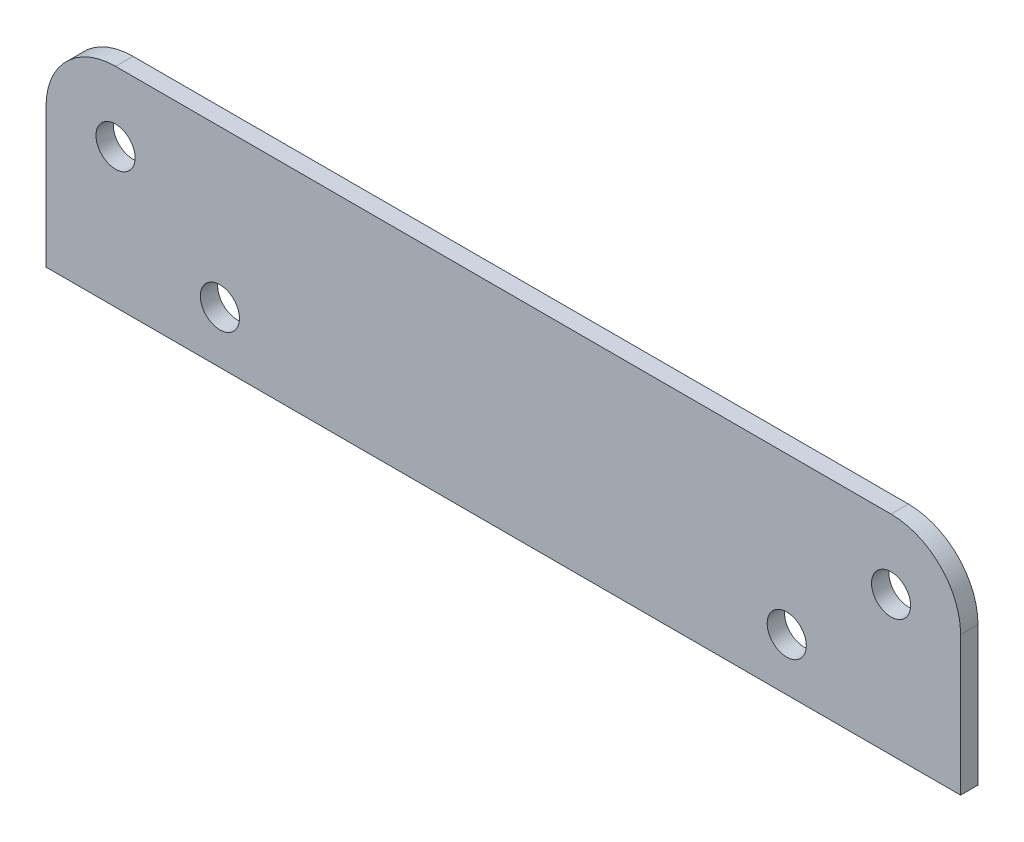
ISO-10303-21;
HEADER;
FILE_DESCRIPTION(('STEP AP214'),'2;1');
FILE_NAME('part.step','',(''),(''),'','','');
FILE_SCHEMA(('AUTOMOTIVE_DESIGN { 1 0 10303 214 1 1 1 1 }'));
ENDSEC;
DATA;
#1=APPLICATION_CONTEXT('core data for automotive mechanical design processes');
#2=APPLICATION_PROTOCOL_DEFINITION('international standard','automotive_design',2000,#1);
#3=PRODUCT_CONTEXT('',#1,'mechanical');
#4=PRODUCT('Part','Part','',(#3));
#5=PRODUCT_RELATED_PRODUCT_CATEGORY('part','',(#4));
#6=PRODUCT_DEFINITION_FORMATION('','',#4);
#7=PRODUCT_DEFINITION_CONTEXT('part definition',#1,'design');
#8=PRODUCT_DEFINITION('design','',#6,#7);
#9=PRODUCT_DEFINITION_SHAPE('','',#8);
#10=(LENGTH_UNIT() NAMED_UNIT(*) SI_UNIT(.MILLI.,.METRE.));
#11=(NAMED_UNIT(*) PLANE_ANGLE_UNIT() SI_UNIT($,.RADIAN.));
#12=(NAMED_UNIT(*) SI_UNIT($,.STERADIAN.) SOLID_ANGLE_UNIT());
#13=UNCERTAINTY_MEASURE_WITH_UNIT(LENGTH_MEASURE(1.E-05),#10,'distance_accuracy_value','');
#14=(GEOMETRIC_REPRESENTATION_CONTEXT(3) GLOBAL_UNCERTAINTY_ASSIGNED_CONTEXT((#13)) GLOBAL_UNIT_ASSIGNED_CONTEXT((#10,
#11,#12)) REPRESENTATION_CONTEXT('',''));
#15=CARTESIAN_POINT('',(0.,0.,0.));
#16=DIRECTION('',(0.,0.,1.));
#17=DIRECTION('',(1.,0.,0.));
#18=AXIS2_PLACEMENT_3D('',#15,#16,#17);
#19=CARTESIAN_POINT('',(83.5025000000007,-1713.14345438019,3.17500000000148));
#20=DIRECTION('',(-1.,0.,0.));
#21=DIRECTION('',(0.,0.,1.));
#22=AXIS2_PLACEMENT_3D('',#19,#20,#21);
#23=PLANE('',#22);
#24=DIRECTION('',(0.,1.,0.));
#25=VECTOR('',#24,1.);
#26=CARTESIAN_POINT('',(83.5025000000004,-1713.14345438019,0.));
#27=LINE('',#26,#25);
#28=CARTESIAN_POINT('',(83.5025000000004,-1713.14345438019,0.));
#29=VERTEX_POINT('',#28);
#30=CARTESIAN_POINT('',(83.5025000000004,-1687.74345438019,0.));
#31=VERTEX_POINT('',#30);
#32=EDGE_CURVE('E130',#29,#31,#27,.T.);
#33=ORIENTED_EDGE('',*,*,#32,.T.);
#34=DIRECTION('',(0.,0.,-1.));
#35=VECTOR('',#34,1.);
#36=CARTESIAN_POINT('',(83.5025000000006,-1687.74345438019,3.17499999999615));
#37=LINE('',#36,#35);
#38=CARTESIAN_POINT('',(83.5025000000006,-1687.74345438019,3.17499999999615));
#39=VERTEX_POINT('',#38);
#40=EDGE_CURVE('E69',#31,#39,#37,.F.);
#41=ORIENTED_EDGE('',*,*,#40,.T.);
#42=DIRECTION('',(0.,1.,0.));
#43=VECTOR('',#42,1.);
#44=CARTESIAN_POINT('',(83.5025000000007,-1713.14345438019,3.17500000000148));
#45=LINE('',#44,#43);
#46=CARTESIAN_POINT('',(83.5025000000007,-1713.14345438019,3.17500000000148));
#47=VERTEX_POINT('',#46);
#48=EDGE_CURVE('E141',#47,#39,#45,.T.);
#49=ORIENTED_EDGE('',*,*,#48,.F.);
#50=DIRECTION('',(0.,0.,-1.));
#51=VECTOR('',#50,1.);
#52=CARTESIAN_POINT('',(83.5025000000007,-1713.14345438019,3.17500000000148));
#53=LINE('',#52,#51);
#54=EDGE_CURVE('E119',#47,#29,#53,.T.);
#55=ORIENTED_EDGE('',*,*,#54,.T.);
#56=EDGE_LOOP('',(#33,#41,#49,#55));
#57=FACE_BOUND('',#56,.T.);
#58=ADVANCED_FACE('F45',(#57),#23,.F.);
#59=CARTESIAN_POINT('',(83.5025000000007,-1675.04345438019,3.17500000000059));
#60=DIRECTION('',(0.,-1.,0.));
#61=DIRECTION('',(0.,0.,-1.));
#62=AXIS2_PLACEMENT_3D('',#59,#60,#61);
#63=PLANE('',#62);
#64=DIRECTION('',(-1.,0.,0.));
#65=VECTOR('',#64,1.);
#66=CARTESIAN_POINT('',(83.5025000000007,-1675.04345438019,3.17500000000059));
#67=LINE('',#66,#65);
#68=CARTESIAN_POINT('',(70.8025000000006,-1675.04345438019,3.17500000000059));
#69=VERTEX_POINT('',#68);
#70=CARTESIAN_POINT('',(-70.8025,-1675.04345438019,3.17500000000059));
#71=VERTEX_POINT('',#70);
#72=EDGE_CURVE('E108',#69,#71,#67,.T.);
#73=ORIENTED_EDGE('',*,*,#72,.F.);
#74=DIRECTION('',(0.,0.,-1.));
#75=VECTOR('',#74,1.);
#76=CARTESIAN_POINT('',(70.8025000000006,-1675.04345438019,3.17500000000059));
#77=LINE('',#76,#75);
#78=CARTESIAN_POINT('',(70.8025000000003,-1675.04345438019,7.105427357601E-12));
#79=VERTEX_POINT('',#78);
#80=EDGE_CURVE('E145',#69,#79,#77,.T.);
#81=ORIENTED_EDGE('',*,*,#80,.T.);
#82=DIRECTION('',(-1.,0.,0.));
#83=VECTOR('',#82,1.);
#84=CARTESIAN_POINT('',(83.5025000000004,-1675.04345438019,7.105427357601E-12));
#85=LINE('',#84,#83);
#86=CARTESIAN_POINT('',(-70.8025000000002,-1675.04345438019,7.105427357601E-12));
#87=VERTEX_POINT('',#86);
#88=EDGE_CURVE('E133',#79,#87,#85,.T.);
#89=ORIENTED_EDGE('',*,*,#88,.T.);
#90=DIRECTION('',(0.,0.,-1.));
#91=VECTOR('',#90,1.);
#92=CARTESIAN_POINT('',(-70.8025,-1675.04345438019,3.17500000000059));
#93=LINE('',#92,#91);
#94=EDGE_CURVE('E118',#87,#71,#93,.F.);
#95=ORIENTED_EDGE('',*,*,#94,.T.);
#96=EDGE_LOOP('',(#73,#81,#89,#95));
#97=FACE_BOUND('',#96,.T.);
#98=ADVANCED_FACE('F165',(#97),#63,.F.);
#99=CARTESIAN_POINT('',(-83.5024999999999,-1713.14345438019,3.17500000000148));
#100=DIRECTION('',(1.,0.,0.));
#101=DIRECTION('',(0.,1.,0.));
#102=AXIS2_PLACEMENT_3D('',#99,#100,#101);
#103=PLANE('',#102);
#104=DIRECTION('',(0.,-1.,0.));
#105=VECTOR('',#104,1.);
#106=CARTESIAN_POINT('',(-83.5024999999999,-1713.14345438019,3.17500000000148));
#107=LINE('',#106,#105);
#108=CARTESIAN_POINT('',(-83.5025,-1687.74345438019,3.17499999999615));
#109=VERTEX_POINT('',#108);
#110=CARTESIAN_POINT('',(-83.5024999999999,-1713.14345438019,3.17500000000148));
#111=VERTEX_POINT('',#110);
#112=EDGE_CURVE('E99',#109,#111,#107,.T.);
#113=ORIENTED_EDGE('',*,*,#112,.F.);
#114=DIRECTION('',(0.,0.,-1.));
#115=VECTOR('',#114,1.);
#116=CARTESIAN_POINT('',(-83.5025,-1687.74345438019,3.17499999999615));
#117=LINE('',#116,#115);
#118=CARTESIAN_POINT('',(-83.5025000000002,-1687.74345438019,0.));
#119=VERTEX_POINT('',#118);
#120=EDGE_CURVE('E11',#109,#119,#117,.T.);
#121=ORIENTED_EDGE('',*,*,#120,.T.);
#122=DIRECTION('',(0.,-1.,0.));
#123=VECTOR('',#122,1.);
#124=CARTESIAN_POINT('',(-83.5025000000004,-1713.14345438019,0.));
#125=LINE('',#124,#123);
#126=CARTESIAN_POINT('',(-83.5025000000004,-1713.14345438019,0.));
#127=VERTEX_POINT('',#126);
#128=EDGE_CURVE('E114',#119,#127,#125,.T.);
#129=ORIENTED_EDGE('',*,*,#128,.T.);
#130=DIRECTION('',(0.,0.,-1.));
#131=VECTOR('',#130,1.);
#132=CARTESIAN_POINT('',(-83.5024999999999,-1713.14345438019,3.17500000000148));
#133=LINE('',#132,#131);
#134=EDGE_CURVE('E111',#111,#127,#133,.T.);
#135=ORIENTED_EDGE('',*,*,#134,.F.);
#136=EDGE_LOOP('',(#113,#121,#129,#135));
#137=FACE_BOUND('',#136,.T.);
#138=ADVANCED_FACE('F112',(#137),#103,.F.);
#139=CARTESIAN_POINT('',(83.5025000000007,-1713.14345438019,3.17500000000148));
#140=DIRECTION('',(0.,1.,0.));
#141=DIRECTION('',(0.,0.,1.));
#142=AXIS2_PLACEMENT_3D('',#139,#140,#141);
#143=PLANE('',#142);
#144=DIRECTION('',(1.,0.,0.));
#145=VECTOR('',#144,1.);
#146=CARTESIAN_POINT('',(83.5025000000004,-1713.14345438019,0.));
#147=LINE('',#146,#145);
#148=EDGE_CURVE('E140',#127,#29,#147,.T.);
#149=ORIENTED_EDGE('',*,*,#148,.T.);
#150=ORIENTED_EDGE('',*,*,#54,.F.);
#151=DIRECTION('',(1.,0.,0.));
#152=VECTOR('',#151,1.);
#153=CARTESIAN_POINT('',(83.5025000000007,-1713.14345438019,3.17500000000148));
#154=LINE('',#153,#152);
#155=EDGE_CURVE('E103',#111,#47,#154,.T.);
#156=ORIENTED_EDGE('',*,*,#155,.F.);
#157=ORIENTED_EDGE('',*,*,#134,.T.);
#158=EDGE_LOOP('',(#149,#150,#156,#157));
#159=FACE_BOUND('',#158,.T.);
#160=ADVANCED_FACE('F121',(#159),#143,.F.);
#161=CARTESIAN_POINT('',(0.,1.33226762955019E-12,3.17500000000059));
#162=DIRECTION('',(0.,0.,1.));
#163=DIRECTION('',(1.,0.,0.));
#164=AXIS2_PLACEMENT_3D('',#161,#162,#163);
#165=PLANE('',#164);
#166=CARTESIAN_POINT('',(-70.8025000000001,-1687.74345438019,3.17499999999615));
#167=DIRECTION('',(0.,0.,1.));
#168=DIRECTION('',(1.,0.,0.));
#169=AXIS2_PLACEMENT_3D('',#166,#167,#168);
#170=CIRCLE('',#169,3.57124);
#171=CARTESIAN_POINT('',(-67.2312600000001,-1687.74345438019,3.17499999999615));
#172=VERTEX_POINT('',#171);
#173=EDGE_CURVE('E202',#172,#172,#170,.T.);
#174=ORIENTED_EDGE('',*,*,#173,.F.);
#175=EDGE_LOOP('',(#174));
#176=FACE_BOUND('',#175,.T.);
#177=CARTESIAN_POINT('',(70.8025000000003,-1687.74345438019,3.17500000000326));
#178=DIRECTION('',(0.,0.,1.));
#179=DIRECTION('',(1.,0.,0.));
#180=AXIS2_PLACEMENT_3D('',#177,#178,#179);
#181=CIRCLE('',#180,3.57124);
#182=CARTESIAN_POINT('',(74.3737400000003,-1687.74345438019,3.17500000000326));
#183=VERTEX_POINT('',#182);
#184=EDGE_CURVE('E195',#183,#183,#181,.T.);
#185=ORIENTED_EDGE('',*,*,#184,.F.);
#186=EDGE_LOOP('',(#185));
#187=FACE_BOUND('',#186,.T.);
#188=CARTESIAN_POINT('',(51.7525000000002,-1703.61845438019,3.17500000000059));
#189=DIRECTION('',(0.,0.,1.));
#190=DIRECTION('',(1.,0.,0.));
#191=AXIS2_PLACEMENT_3D('',#188,#189,#190);
#192=CIRCLE('',#191,3.57124);
#193=CARTESIAN_POINT('',(55.3237400000002,-1703.61845438019,3.17500000000059));
#194=VERTEX_POINT('',#193);
#195=EDGE_CURVE('E187',#194,#194,#192,.T.);
#196=ORIENTED_EDGE('',*,*,#195,.F.);
#197=EDGE_LOOP('',(#196));
#198=FACE_BOUND('',#197,.T.);
#199=CARTESIAN_POINT('',(-51.7524999999996,-1703.61845438019,3.17500000002191));
#200=DIRECTION('',(0.,0.,1.));
#201=DIRECTION('',(1.,0.,0.));
#202=AXIS2_PLACEMENT_3D('',#199,#200,#201);
#203=CIRCLE('',#202,3.57124);
#204=CARTESIAN_POINT('',(-48.1812599999996,-1703.61845438019,3.17500000002191));
#205=VERTEX_POINT('',#204);
#206=EDGE_CURVE('E179',#205,#205,#203,.T.);
#207=ORIENTED_EDGE('',*,*,#206,.F.);
#208=EDGE_LOOP('',(#207));
#209=FACE_BOUND('',#208,.T.);
#210=ORIENTED_EDGE('',*,*,#48,.T.);
#211=CARTESIAN_POINT('',(70.8025000000003,-1687.74345438019,3.17500000000326));
#212=DIRECTION('',(0.,0.,1.));
#213=DIRECTION('',(1.,0.,0.));
#214=AXIS2_PLACEMENT_3D('',#211,#212,#213);
#215=CIRCLE('',#214,12.7);
#216=EDGE_CURVE('E54',#39,#69,#215,.T.);
#217=ORIENTED_EDGE('',*,*,#216,.T.);
#218=ORIENTED_EDGE('',*,*,#72,.T.);
#219=CARTESIAN_POINT('',(-70.8025000000001,-1687.74345438019,3.17499999999615));
#220=DIRECTION('',(0.,0.,1.));
#221=DIRECTION('',(1.,0.,0.));
#222=AXIS2_PLACEMENT_3D('',#219,#220,#221);
#223=CIRCLE('',#222,12.7);
#224=EDGE_CURVE('E61',#71,#109,#223,.T.);
#225=ORIENTED_EDGE('',*,*,#224,.T.);
#226=ORIENTED_EDGE('',*,*,#112,.T.);
#227=ORIENTED_EDGE('',*,*,#155,.T.);
#228=EDGE_LOOP('',(#210,#217,#218,#225,#226,#227));
#229=FACE_BOUND('',#228,.T.);
#230=ADVANCED_FACE('F101',(#176,#187,#198,#209,#229),#165,.T.);
#231=CARTESIAN_POINT('',(0.,0.,0.));
#232=DIRECTION('',(0.,0.,1.));
#233=DIRECTION('',(1.,0.,0.));
#234=AXIS2_PLACEMENT_3D('',#231,#232,#233);
#235=PLANE('',#234);
#236=CARTESIAN_POINT('',(-70.8025000000001,-1687.74345438019,0.));
#237=DIRECTION('',(0.,0.,1.));
#238=DIRECTION('',(1.,0.,0.));
#239=AXIS2_PLACEMENT_3D('',#236,#237,#238);
#240=CIRCLE('',#239,3.57124);
#241=CARTESIAN_POINT('',(-67.2312600000001,-1687.74345438019,0.));
#242=VERTEX_POINT('',#241);
#243=EDGE_CURVE('E198',#242,#242,#240,.T.);
#244=ORIENTED_EDGE('',*,*,#243,.T.);
#245=EDGE_LOOP('',(#244));
#246=FACE_BOUND('',#245,.T.);
#247=CARTESIAN_POINT('',(70.8025000000003,-1687.74345438019,0.));
#248=DIRECTION('',(0.,0.,1.));
#249=DIRECTION('',(1.,0.,0.));
#250=AXIS2_PLACEMENT_3D('',#247,#248,#249);
#251=CIRCLE('',#250,3.57124);
#252=CARTESIAN_POINT('',(74.3737400000003,-1687.74345438019,0.));
#253=VERTEX_POINT('',#252);
#254=EDGE_CURVE('E191',#253,#253,#251,.T.);
#255=ORIENTED_EDGE('',*,*,#254,.T.);
#256=EDGE_LOOP('',(#255));
#257=FACE_BOUND('',#256,.T.);
#258=CARTESIAN_POINT('',(51.7525000000003,-1703.61845438019,7.105427357601E-12));
#259=DIRECTION('',(0.,0.,1.));
#260=DIRECTION('',(1.,0.,0.));
#261=AXIS2_PLACEMENT_3D('',#258,#259,#260);
#262=CIRCLE('',#261,3.57124);
#263=CARTESIAN_POINT('',(55.3237400000002,-1703.61845438019,7.10522911395728E-12));
#264=VERTEX_POINT('',#263);
#265=EDGE_CURVE('E183',#264,#264,#262,.T.);
#266=ORIENTED_EDGE('',*,*,#265,.T.);
#267=EDGE_LOOP('',(#266));
#268=FACE_BOUND('',#267,.T.);
#269=CARTESIAN_POINT('',(-51.7524999999996,-1703.61845438019,4.44089209850063E-12));
#270=DIRECTION('',(0.,0.,1.));
#271=DIRECTION('',(1.,0.,0.));
#272=AXIS2_PLACEMENT_3D('',#269,#270,#271);
#273=CIRCLE('',#272,3.57124);
#274=CARTESIAN_POINT('',(-48.1812599999996,-1703.61845438019,4.4406938548569E-12));
#275=VERTEX_POINT('',#274);
#276=EDGE_CURVE('E134',#275,#275,#273,.T.);
#277=ORIENTED_EDGE('',*,*,#276,.T.);
#278=EDGE_LOOP('',(#277));
#279=FACE_BOUND('',#278,.T.);
#280=ORIENTED_EDGE('',*,*,#88,.F.);
#281=CARTESIAN_POINT('',(70.8025000000003,-1687.74345438019,0.));
#282=DIRECTION('',(0.,0.,1.));
#283=DIRECTION('',(1.,0.,0.));
#284=AXIS2_PLACEMENT_3D('',#281,#282,#283);
#285=CIRCLE('',#284,12.7);
#286=EDGE_CURVE('E152',#79,#31,#285,.F.);
#287=ORIENTED_EDGE('',*,*,#286,.T.);
#288=ORIENTED_EDGE('',*,*,#32,.F.);
#289=ORIENTED_EDGE('',*,*,#148,.F.);
#290=ORIENTED_EDGE('',*,*,#128,.F.);
#291=CARTESIAN_POINT('',(-70.8025000000001,-1687.74345438019,0.));
#292=DIRECTION('',(0.,0.,1.));
#293=DIRECTION('',(1.,0.,0.));
#294=AXIS2_PLACEMENT_3D('',#291,#292,#293);
#295=CIRCLE('',#294,12.7);
#296=EDGE_CURVE('E149',#119,#87,#295,.F.);
#297=ORIENTED_EDGE('',*,*,#296,.T.);
#298=EDGE_LOOP('',(#280,#287,#288,#289,#290,#297));
#299=FACE_BOUND('',#298,.T.);
#300=ADVANCED_FACE('F172',(#246,#257,#268,#279,#299),#235,.F.);
#301=CARTESIAN_POINT('',(70.8025000000003,-1687.74345438019,3.17500000000326));
#302=DIRECTION('',(0.,0.,-1.));
#303=DIRECTION('',(-1.,0.,0.));
#304=AXIS2_PLACEMENT_3D('',#301,#302,#303);
#305=CYLINDRICAL_SURFACE('',#304,12.7);
#306=ORIENTED_EDGE('',*,*,#216,.F.);
#307=ORIENTED_EDGE('',*,*,#40,.F.);
#308=ORIENTED_EDGE('',*,*,#286,.F.);
#309=ORIENTED_EDGE('',*,*,#80,.F.);
#310=EDGE_LOOP('',(#306,#307,#308,#309));
#311=FACE_BOUND('',#310,.T.);
#312=ADVANCED_FACE('F169',(#311),#305,.T.);
#313=CARTESIAN_POINT('',(-70.8025000000001,-1687.74345438019,3.17499999999615));
#314=DIRECTION('',(0.,0.,-1.));
#315=DIRECTION('',(-1.,0.,0.));
#316=AXIS2_PLACEMENT_3D('',#313,#314,#315);
#317=CYLINDRICAL_SURFACE('',#316,12.7);
#318=ORIENTED_EDGE('',*,*,#224,.F.);
#319=ORIENTED_EDGE('',*,*,#94,.F.);
#320=ORIENTED_EDGE('',*,*,#296,.F.);
#321=ORIENTED_EDGE('',*,*,#120,.F.);
#322=EDGE_LOOP('',(#318,#319,#320,#321));
#323=FACE_BOUND('',#322,.T.);
#324=ADVANCED_FACE('F47',(#323),#317,.T.);
#325=CARTESIAN_POINT('',(-51.7524999999996,-1703.61845438019,3.17500000002191));
#326=DIRECTION('',(0.,0.,1.));
#327=DIRECTION('',(1.,0.,0.));
#328=AXIS2_PLACEMENT_3D('',#325,#326,#327);
#329=CYLINDRICAL_SURFACE('',#328,3.57124);
#330=ORIENTED_EDGE('',*,*,#276,.F.);
#331=EDGE_LOOP('',(#330));
#332=FACE_BOUND('',#331,.T.);
#333=ORIENTED_EDGE('',*,*,#206,.T.);
#334=EDGE_LOOP('',(#333));
#335=FACE_BOUND('',#334,.T.);
#336=ADVANCED_FACE('F218',(#332,#335),#329,.F.);
#337=CARTESIAN_POINT('',(51.7525000000002,-1703.61845438019,3.17500000000059));
#338=DIRECTION('',(0.,0.,1.));
#339=DIRECTION('',(1.,0.,0.));
#340=AXIS2_PLACEMENT_3D('',#337,#338,#339);
#341=CYLINDRICAL_SURFACE('',#340,3.57124);
#342=ORIENTED_EDGE('',*,*,#265,.F.);
#343=EDGE_LOOP('',(#342));
#344=FACE_BOUND('',#343,.T.);
#345=ORIENTED_EDGE('',*,*,#195,.T.);
#346=EDGE_LOOP('',(#345));
#347=FACE_BOUND('',#346,.T.);
#348=ADVANCED_FACE('F220',(#344,#347),#341,.F.);
#349=CARTESIAN_POINT('',(70.8025000000003,-1687.74345438019,3.17500000000326));
#350=DIRECTION('',(0.,0.,1.));
#351=DIRECTION('',(1.,0.,0.));
#352=AXIS2_PLACEMENT_3D('',#349,#350,#351);
#353=CYLINDRICAL_SURFACE('',#352,3.57124);
#354=ORIENTED_EDGE('',*,*,#254,.F.);
#355=EDGE_LOOP('',(#354));
#356=FACE_BOUND('',#355,.T.);
#357=ORIENTED_EDGE('',*,*,#184,.T.);
#358=EDGE_LOOP('',(#357));
#359=FACE_BOUND('',#358,.T.);
#360=ADVANCED_FACE('F227',(#356,#359),#353,.F.);
#361=CARTESIAN_POINT('',(-70.8025000000001,-1687.74345438019,3.17499999999615));
#362=DIRECTION('',(0.,0.,1.));
#363=DIRECTION('',(1.,0.,0.));
#364=AXIS2_PLACEMENT_3D('',#361,#362,#363);
#365=CYLINDRICAL_SURFACE('',#364,3.57124);
#366=ORIENTED_EDGE('',*,*,#243,.F.);
#367=EDGE_LOOP('',(#366));
#368=FACE_BOUND('',#367,.T.);
#369=ORIENTED_EDGE('',*,*,#173,.T.);
#370=EDGE_LOOP('',(#369));
#371=FACE_BOUND('',#370,.T.);
#372=ADVANCED_FACE('F207',(#368,#371),#365,.F.);
#373=CLOSED_SHELL('',(#58,#98,#138,#160,#230,#300,#312,#324,#336,#348,#360,#372));
#374=MANIFOLD_SOLID_BREP('B2',#373);
#375=ADVANCED_BREP_SHAPE_REPRESENTATION('',(#18,#374),#14);
#376=SHAPE_DEFINITION_REPRESENTATION(#9,#375);
ENDSEC;
END-ISO-10303-21;
